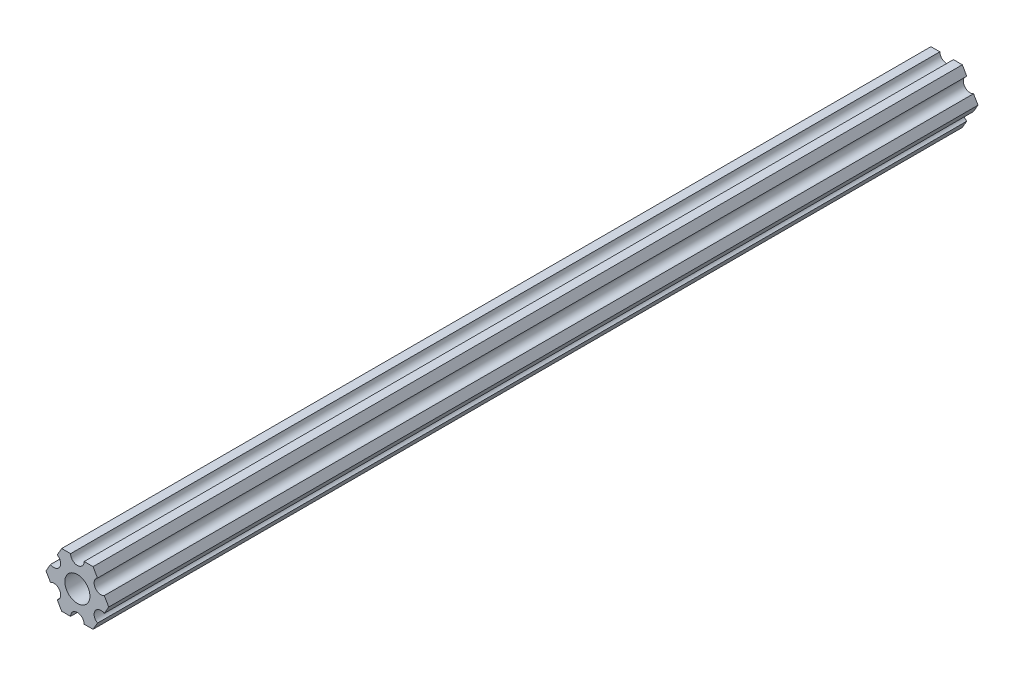
ISO-10303-21;
HEADER;
FILE_DESCRIPTION(('STEP AP214'),'2;1');
FILE_NAME('part.step','',(''),(''),'','','');
FILE_SCHEMA(('AUTOMOTIVE_DESIGN { 1 0 10303 214 1 1 1 1 }'));
ENDSEC;
DATA;
#1=APPLICATION_CONTEXT('core data for automotive mechanical design processes');
#2=APPLICATION_PROTOCOL_DEFINITION('international standard','automotive_design',2000,#1);
#3=PRODUCT_CONTEXT('',#1,'mechanical');
#4=PRODUCT('Part','Part','',(#3));
#5=PRODUCT_RELATED_PRODUCT_CATEGORY('part','',(#4));
#6=PRODUCT_DEFINITION_FORMATION('','',#4);
#7=PRODUCT_DEFINITION_CONTEXT('part definition',#1,'design');
#8=PRODUCT_DEFINITION('design','',#6,#7);
#9=PRODUCT_DEFINITION_SHAPE('','',#8);
#10=(LENGTH_UNIT() NAMED_UNIT(*) SI_UNIT(.MILLI.,.METRE.));
#11=(NAMED_UNIT(*) PLANE_ANGLE_UNIT() SI_UNIT($,.RADIAN.));
#12=(NAMED_UNIT(*) SI_UNIT($,.STERADIAN.) SOLID_ANGLE_UNIT());
#13=UNCERTAINTY_MEASURE_WITH_UNIT(LENGTH_MEASURE(1.E-05),#10,'distance_accuracy_value','');
#14=(GEOMETRIC_REPRESENTATION_CONTEXT(3) GLOBAL_UNCERTAINTY_ASSIGNED_CONTEXT((#13)) GLOBAL_UNIT_ASSIGNED_CONTEXT((#10,
#11,#12)) REPRESENTATION_CONTEXT('',''));
#15=CARTESIAN_POINT('',(0.,0.,0.));
#16=DIRECTION('',(0.,0.,1.));
#17=DIRECTION('',(1.,0.,0.));
#18=AXIS2_PLACEMENT_3D('',#15,#16,#17);
#19=CARTESIAN_POINT('',(-5.49926150638083,-3.17499966684068,-203.2));
#20=DIRECTION('',(0.,0.,1.));
#21=DIRECTION('',(1.,0.,0.));
#22=AXIS2_PLACEMENT_3D('',#19,#20,#21);
#23=CYLINDRICAL_SURFACE('',#22,1.58750000000001);
#24=CARTESIAN_POINT('',(-5.49926150638083,-3.17499966684068,0.));
#25=DIRECTION('',(0.,0.,-1.));
#26=DIRECTION('',(-1.,0.,0.));
#27=AXIS2_PLACEMENT_3D('',#24,#25,#26);
#28=CIRCLE('',#27,1.58750000000001);
#29=CARTESIAN_POINT('',(-6.29301142309098,-1.80018429024546,0.));
#30=VERTEX_POINT('',#29);
#31=CARTESIAN_POINT('',(-4.70551158967068,-4.54981504343589,0.));
#32=VERTEX_POINT('',#31);
#33=EDGE_CURVE('E190',#30,#32,#28,.T.);
#34=ORIENTED_EDGE('',*,*,#33,.F.);
#35=DIRECTION('',(0.,0.,1.));
#36=VECTOR('',#35,1.);
#37=CARTESIAN_POINT('',(-6.29301142309098,-1.80018429024546,-203.2));
#38=LINE('',#37,#36);
#39=CARTESIAN_POINT('',(-6.29301142309098,-1.80018429024546,-203.2));
#40=VERTEX_POINT('',#39);
#41=EDGE_CURVE('E11',#40,#30,#38,.T.);
#42=ORIENTED_EDGE('',*,*,#41,.F.);
#43=CARTESIAN_POINT('',(-5.49926150638083,-3.17499966684068,-203.2));
#44=DIRECTION('',(0.,0.,-1.));
#45=DIRECTION('',(-1.,0.,0.));
#46=AXIS2_PLACEMENT_3D('',#43,#44,#45);
#47=CIRCLE('',#46,1.58750000000001);
#48=CARTESIAN_POINT('',(-4.70551158967068,-4.54981504343589,-203.2));
#49=VERTEX_POINT('',#48);
#50=EDGE_CURVE('E241',#40,#49,#47,.T.);
#51=ORIENTED_EDGE('',*,*,#50,.T.);
#52=DIRECTION('',(0.,0.,1.));
#53=VECTOR('',#52,1.);
#54=CARTESIAN_POINT('',(-4.70551158967068,-4.54981504343589,-203.2));
#55=LINE('',#54,#53);
#56=EDGE_CURVE('E36',#49,#32,#55,.T.);
#57=ORIENTED_EDGE('',*,*,#56,.T.);
#58=EDGE_LOOP('',(#34,#42,#51,#57));
#59=FACE_BOUND('',#58,.T.);
#60=ADVANCED_FACE('F33',(#59),#23,.F.);
#61=CARTESIAN_POINT('',(-7.33234841870826,4.44212518856872E-07,-203.2));
#62=DIRECTION('',(-0.866025434075723,-0.499999947533953,0.));
#63=DIRECTION('',(0.499999947533953,-0.866025434075723,0.));
#64=AXIS2_PLACEMENT_3D('',#61,#62,#63);
#65=PLANE('',#64);
#66=DIRECTION('',(0.499999947533953,-0.866025434075723,0.));
#67=VECTOR('',#66,1.);
#68=CARTESIAN_POINT('',(-7.33234841870826,4.44212518856872E-07,0.));
#69=LINE('',#68,#67);
#70=CARTESIAN_POINT('',(-7.33234841870826,4.44212518856872E-07,0.));
#71=VERTEX_POINT('',#70);
#72=EDGE_CURVE('E239',#71,#30,#69,.T.);
#73=ORIENTED_EDGE('',*,*,#72,.F.);
#74=DIRECTION('',(0.,0.,1.));
#75=VECTOR('',#74,1.);
#76=CARTESIAN_POINT('',(-7.33234841870826,4.44212518856872E-07,-203.2));
#77=LINE('',#76,#75);
#78=CARTESIAN_POINT('',(-7.33234841870826,4.44212518856872E-07,-203.2));
#79=VERTEX_POINT('',#78);
#80=EDGE_CURVE('E42',#79,#71,#77,.T.);
#81=ORIENTED_EDGE('',*,*,#80,.F.);
#82=DIRECTION('',(0.499999947533953,-0.866025434075723,0.));
#83=VECTOR('',#82,1.);
#84=CARTESIAN_POINT('',(-7.33234841870826,4.44212518856872E-07,-203.2));
#85=LINE('',#84,#83);
#86=EDGE_CURVE('E180',#79,#40,#85,.T.);
#87=ORIENTED_EDGE('',*,*,#86,.T.);
#88=ORIENTED_EDGE('',*,*,#41,.T.);
#89=EDGE_LOOP('',(#73,#81,#87,#88));
#90=FACE_BOUND('',#89,.T.);
#91=ADVANCED_FACE('F273',(#90),#65,.T.);
#92=CARTESIAN_POINT('',(-6.29301120497139,1.80018505273895,-203.2));
#93=DIRECTION('',(-0.866025373493145,0.500000052466056,0.));
#94=DIRECTION('',(-0.500000052466056,-0.866025373493145,0.));
#95=AXIS2_PLACEMENT_3D('',#92,#93,#94);
#96=PLANE('',#95);
#97=DIRECTION('',(-0.500000052466056,-0.866025373493145,0.));
#98=VECTOR('',#97,1.);
#99=CARTESIAN_POINT('',(-6.29301120497139,1.80018505273895,0.));
#100=LINE('',#99,#98);
#101=CARTESIAN_POINT('',(-6.29301120497139,1.80018505273895,0.));
#102=VERTEX_POINT('',#101);
#103=EDGE_CURVE('E167',#102,#71,#100,.T.);
#104=ORIENTED_EDGE('',*,*,#103,.F.);
#105=DIRECTION('',(0.,0.,1.));
#106=VECTOR('',#105,1.);
#107=CARTESIAN_POINT('',(-6.29301120497139,1.80018505273895,-203.2));
#108=LINE('',#107,#106);
#109=CARTESIAN_POINT('',(-6.29301120497139,1.80018505273895,-203.2));
#110=VERTEX_POINT('',#109);
#111=EDGE_CURVE('E162',#110,#102,#108,.T.);
#112=ORIENTED_EDGE('',*,*,#111,.F.);
#113=DIRECTION('',(-0.500000052466056,-0.866025373493145,0.));
#114=VECTOR('',#113,1.);
#115=CARTESIAN_POINT('',(-6.29301120497139,1.80018505273895,-203.2));
#116=LINE('',#115,#114);
#117=EDGE_CURVE('E165',#110,#79,#116,.T.);
#118=ORIENTED_EDGE('',*,*,#117,.T.);
#119=ORIENTED_EDGE('',*,*,#80,.T.);
#120=EDGE_LOOP('',(#104,#112,#118,#119));
#121=FACE_BOUND('',#120,.T.);
#122=ADVANCED_FACE('F164',(#121),#96,.T.);
#123=CARTESIAN_POINT('',(-5.49926112168152,3.17500033315931,-203.2));
#124=DIRECTION('',(0.,0.,1.));
#125=DIRECTION('',(1.,0.,0.));
#126=AXIS2_PLACEMENT_3D('',#123,#124,#125);
#127=CYLINDRICAL_SURFACE('',#126,1.5875);
#128=CARTESIAN_POINT('',(-5.49926112168152,3.17500033315931,0.));
#129=DIRECTION('',(0.,0.,-1.));
#130=DIRECTION('',(-1.,0.,0.));
#131=AXIS2_PLACEMENT_3D('',#128,#129,#130);
#132=CIRCLE('',#131,1.5875);
#133=CARTESIAN_POINT('',(-4.70551103839166,4.54981561357968,0.));
#134=VERTEX_POINT('',#133);
#135=EDGE_CURVE('E236',#134,#102,#132,.T.);
#136=ORIENTED_EDGE('',*,*,#135,.F.);
#137=DIRECTION('',(0.,0.,1.));
#138=VECTOR('',#137,1.);
#139=CARTESIAN_POINT('',(-4.70551103839166,4.54981561357968,-203.2));
#140=LINE('',#139,#138);
#141=CARTESIAN_POINT('',(-4.70551103839166,4.54981561357968,-203.2));
#142=VERTEX_POINT('',#141);
#143=EDGE_CURVE('E172',#142,#134,#140,.T.);
#144=ORIENTED_EDGE('',*,*,#143,.F.);
#145=CARTESIAN_POINT('',(-5.49926112168152,3.17500033315931,-203.2));
#146=DIRECTION('',(0.,0.,-1.));
#147=DIRECTION('',(-1.,0.,0.));
#148=AXIS2_PLACEMENT_3D('',#145,#146,#147);
#149=CIRCLE('',#148,1.5875);
#150=EDGE_CURVE('E178',#142,#110,#149,.T.);
#151=ORIENTED_EDGE('',*,*,#150,.T.);
#152=ORIENTED_EDGE('',*,*,#111,.T.);
#153=EDGE_LOOP('',(#136,#144,#151,#152));
#154=FACE_BOUND('',#153,.T.);
#155=ADVANCED_FACE('F182',(#154),#127,.F.);
#156=CARTESIAN_POINT('',(-3.66617382465472,6.35000022210622,-203.2));
#157=DIRECTION('',(-0.866025373493145,0.500000052466056,0.));
#158=DIRECTION('',(-0.500000052466056,-0.866025373493145,0.));
#159=AXIS2_PLACEMENT_3D('',#156,#157,#158);
#160=PLANE('',#159);
#161=DIRECTION('',(-0.500000052466056,-0.866025373493145,0.));
#162=VECTOR('',#161,1.);
#163=CARTESIAN_POINT('',(-3.66617382465472,6.35000022210622,0.));
#164=LINE('',#163,#162);
#165=CARTESIAN_POINT('',(-3.66617382465472,6.35000022210622,0.));
#166=VERTEX_POINT('',#165);
#167=EDGE_CURVE('E233',#166,#134,#164,.T.);
#168=ORIENTED_EDGE('',*,*,#167,.F.);
#169=DIRECTION('',(0.,0.,1.));
#170=VECTOR('',#169,1.);
#171=CARTESIAN_POINT('',(-3.66617382465472,6.35000022210622,-203.2));
#172=LINE('',#171,#170);
#173=CARTESIAN_POINT('',(-3.66617382465472,6.35000022210622,-203.2));
#174=VERTEX_POINT('',#173);
#175=EDGE_CURVE('E245',#174,#166,#172,.T.);
#176=ORIENTED_EDGE('',*,*,#175,.F.);
#177=DIRECTION('',(-0.500000052466056,-0.866025373493145,0.));
#178=VECTOR('',#177,1.);
#179=CARTESIAN_POINT('',(-3.66617382465472,6.35000022210622,-203.2));
#180=LINE('',#179,#178);
#181=EDGE_CURVE('E183',#174,#142,#180,.T.);
#182=ORIENTED_EDGE('',*,*,#181,.T.);
#183=ORIENTED_EDGE('',*,*,#143,.T.);
#184=EDGE_LOOP('',(#168,#176,#182,#183));
#185=FACE_BOUND('',#184,.T.);
#186=ADVANCED_FACE('F286',(#185),#160,.T.);
#187=CARTESIAN_POINT('',(-1.58749884590197,6.35000022210623,-203.2));
#188=DIRECTION('',(0.,1.,0.));
#189=DIRECTION('',(-1.,0.,0.));
#190=AXIS2_PLACEMENT_3D('',#187,#188,#189);
#191=PLANE('',#190);
#192=DIRECTION('',(-1.,0.,0.));
#193=VECTOR('',#192,1.);
#194=CARTESIAN_POINT('',(-1.58749884590197,6.35000022210623,0.));
#195=LINE('',#194,#193);
#196=CARTESIAN_POINT('',(-1.58749884590197,6.35000022210623,0.));
#197=VERTEX_POINT('',#196);
#198=EDGE_CURVE('E230',#197,#166,#195,.T.);
#199=ORIENTED_EDGE('',*,*,#198,.F.);
#200=DIRECTION('',(0.,0.,1.));
#201=VECTOR('',#200,1.);
#202=CARTESIAN_POINT('',(-1.58749884590197,6.35000022210623,-203.2));
#203=LINE('',#202,#201);
#204=CARTESIAN_POINT('',(-1.58749884590197,6.35000022210623,-203.2));
#205=VERTEX_POINT('',#204);
#206=EDGE_CURVE('E247',#205,#197,#203,.T.);
#207=ORIENTED_EDGE('',*,*,#206,.F.);
#208=DIRECTION('',(-1.,0.,0.));
#209=VECTOR('',#208,1.);
#210=CARTESIAN_POINT('',(-1.58749884590197,6.35000022210623,-203.2));
#211=LINE('',#210,#209);
#212=EDGE_CURVE('E185',#205,#174,#211,.T.);
#213=ORIENTED_EDGE('',*,*,#212,.T.);
#214=ORIENTED_EDGE('',*,*,#175,.T.);
#215=EDGE_LOOP('',(#199,#207,#213,#214));
#216=FACE_BOUND('',#215,.T.);
#217=ADVANCED_FACE('F289',(#216),#191,.T.);
#218=CARTESIAN_POINT('',(3.84699344941095E-07,6.35000022210623,-203.2));
#219=DIRECTION('',(0.,0.,1.));
#220=DIRECTION('',(1.,0.,0.));
#221=AXIS2_PLACEMENT_3D('',#218,#219,#220);
#222=CYLINDRICAL_SURFACE('',#221,1.58749884590197);
#223=CARTESIAN_POINT('',(3.84699344941095E-07,6.35000022210623,0.));
#224=DIRECTION('',(0.,0.,-1.));
#225=DIRECTION('',(-1.,0.,0.));
#226=AXIS2_PLACEMENT_3D('',#223,#224,#225);
#227=CIRCLE('',#226,1.58749884590197);
#228=CARTESIAN_POINT('',(1.58749923060131,6.35000022210623,0.));
#229=VERTEX_POINT('',#228);
#230=EDGE_CURVE('E227',#229,#197,#227,.T.);
#231=ORIENTED_EDGE('',*,*,#230,.F.);
#232=DIRECTION('',(0.,0.,1.));
#233=VECTOR('',#232,1.);
#234=CARTESIAN_POINT('',(1.58749923060131,6.35000022210623,-203.2));
#235=LINE('',#234,#233);
#236=CARTESIAN_POINT('',(1.58749923060131,6.35000022210623,-203.2));
#237=VERTEX_POINT('',#236);
#238=EDGE_CURVE('E249',#237,#229,#235,.T.);
#239=ORIENTED_EDGE('',*,*,#238,.F.);
#240=CARTESIAN_POINT('',(3.84699344941095E-07,6.35000022210623,-203.2));
#241=DIRECTION('',(0.,0.,-1.));
#242=DIRECTION('',(-1.,0.,0.));
#243=AXIS2_PLACEMENT_3D('',#240,#241,#242);
#244=CIRCLE('',#243,1.58749884590197);
#245=EDGE_CURVE('E394',#237,#205,#244,.T.);
#246=ORIENTED_EDGE('',*,*,#245,.T.);
#247=ORIENTED_EDGE('',*,*,#206,.T.);
#248=EDGE_LOOP('',(#231,#239,#246,#247));
#249=FACE_BOUND('',#248,.T.);
#250=ADVANCED_FACE('F293',(#249),#222,.F.);
#251=CARTESIAN_POINT('',(3.66617452134701,6.35000022210623,-203.2));
#252=DIRECTION('',(0.,1.,0.));
#253=DIRECTION('',(-1.,0.,0.));
#254=AXIS2_PLACEMENT_3D('',#251,#252,#253);
#255=PLANE('',#254);
#256=DIRECTION('',(-1.,0.,0.));
#257=VECTOR('',#256,1.);
#258=CARTESIAN_POINT('',(3.66617452134701,6.35000022210623,0.));
#259=LINE('',#258,#257);
#260=CARTESIAN_POINT('',(3.66617452134701,6.35000022210623,0.));
#261=VERTEX_POINT('',#260);
#262=EDGE_CURVE('E224',#261,#229,#259,.T.);
#263=ORIENTED_EDGE('',*,*,#262,.F.);
#264=DIRECTION('',(0.,0.,1.));
#265=VECTOR('',#264,1.);
#266=CARTESIAN_POINT('',(3.66617452134701,6.35000022210623,-203.2));
#267=LINE('',#266,#265);
#268=CARTESIAN_POINT('',(3.66617452134701,6.35000022210623,-203.2));
#269=VERTEX_POINT('',#268);
#270=EDGE_CURVE('E251',#269,#261,#267,.T.);
#271=ORIENTED_EDGE('',*,*,#270,.F.);
#272=DIRECTION('',(-1.,0.,0.));
#273=VECTOR('',#272,1.);
#274=CARTESIAN_POINT('',(3.66617452134701,6.35000022210623,-203.2));
#275=LINE('',#274,#273);
#276=EDGE_CURVE('E391',#269,#237,#275,.T.);
#277=ORIENTED_EDGE('',*,*,#276,.T.);
#278=ORIENTED_EDGE('',*,*,#238,.T.);
#279=EDGE_LOOP('',(#263,#271,#277,#278));
#280=FACE_BOUND('',#279,.T.);
#281=ADVANCED_FACE('F297',(#280),#255,.T.);
#282=CARTESIAN_POINT('',(4.70551142760333,4.54981551649452,-203.2));
#283=DIRECTION('',(0.866025449221368,0.499999921300922,0.));
#284=DIRECTION('',(-0.499999921300922,0.866025449221368,0.));
#285=AXIS2_PLACEMENT_3D('',#282,#283,#284);
#286=PLANE('',#285);
#287=DIRECTION('',(-0.499999921300922,0.866025449221368,0.));
#288=VECTOR('',#287,1.);
#289=CARTESIAN_POINT('',(4.70551142760333,4.54981551649452,0.));
#290=LINE('',#289,#288);
#291=CARTESIAN_POINT('',(4.70551142760333,4.54981551649452,0.));
#292=VERTEX_POINT('',#291);
#293=EDGE_CURVE('E221',#292,#261,#290,.T.);
#294=ORIENTED_EDGE('',*,*,#293,.F.);
#295=DIRECTION('',(0.,0.,1.));
#296=VECTOR('',#295,1.);
#297=CARTESIAN_POINT('',(4.70551142760333,4.54981551649452,-203.2));
#298=LINE('',#297,#296);
#299=CARTESIAN_POINT('',(4.70551142760333,4.54981551649452,-203.2));
#300=VERTEX_POINT('',#299);
#301=EDGE_CURVE('E253',#300,#292,#298,.T.);
#302=ORIENTED_EDGE('',*,*,#301,.F.);
#303=DIRECTION('',(-0.499999921300922,0.866025449221368,0.));
#304=VECTOR('',#303,1.);
#305=CARTESIAN_POINT('',(4.70551142760333,4.54981551649452,-203.2));
#306=LINE('',#305,#304);
#307=EDGE_CURVE('E388',#300,#269,#306,.T.);
#308=ORIENTED_EDGE('',*,*,#307,.T.);
#309=ORIENTED_EDGE('',*,*,#270,.T.);
#310=EDGE_LOOP('',(#294,#302,#308,#309));
#311=FACE_BOUND('',#310,.T.);
#312=ADVANCED_FACE('F301',(#311),#286,.T.);
#313=CARTESIAN_POINT('',(5.49926130266854,3.1750001158556,-203.2));
#314=DIRECTION('',(0.,0.,1.));
#315=DIRECTION('',(1.,0.,0.));
#316=AXIS2_PLACEMENT_3D('',#313,#314,#315);
#317=CYLINDRICAL_SURFACE('',#316,1.5875);
#318=CARTESIAN_POINT('',(5.49926130266854,3.1750001158556,0.));
#319=DIRECTION('',(0.,0.,-1.));
#320=DIRECTION('',(-1.,0.,0.));
#321=AXIS2_PLACEMENT_3D('',#318,#319,#320);
#322=CIRCLE('',#321,1.5875);
#323=CARTESIAN_POINT('',(6.29301117773375,1.80018471521667,0.));
#324=VERTEX_POINT('',#323);
#325=EDGE_CURVE('E218',#324,#292,#322,.T.);
#326=ORIENTED_EDGE('',*,*,#325,.F.);
#327=DIRECTION('',(0.,0.,1.));
#328=VECTOR('',#327,1.);
#329=CARTESIAN_POINT('',(6.29301117773375,1.80018471521667,-203.2));
#330=LINE('',#329,#328);
#331=CARTESIAN_POINT('',(6.29301117773375,1.80018471521667,-203.2));
#332=VERTEX_POINT('',#331);
#333=EDGE_CURVE('E255',#332,#324,#330,.T.);
#334=ORIENTED_EDGE('',*,*,#333,.F.);
#335=CARTESIAN_POINT('',(5.49926130266854,3.1750001158556,-203.2));
#336=DIRECTION('',(0.,0.,-1.));
#337=DIRECTION('',(-1.,0.,0.));
#338=AXIS2_PLACEMENT_3D('',#335,#336,#337);
#339=CIRCLE('',#338,1.5875);
#340=EDGE_CURVE('E385',#332,#300,#339,.T.);
#341=ORIENTED_EDGE('',*,*,#340,.T.);
#342=ORIENTED_EDGE('',*,*,#301,.T.);
#343=EDGE_LOOP('',(#326,#334,#341,#342));
#344=FACE_BOUND('',#343,.T.);
#345=ADVANCED_FACE('F305',(#344),#317,.F.);
#346=CARTESIAN_POINT('',(7.33234803400895,9.61748368946088E-08,-203.2));
#347=DIRECTION('',(0.866025449221368,0.499999921300922,0.));
#348=DIRECTION('',(-0.499999921300922,0.866025449221368,0.));
#349=AXIS2_PLACEMENT_3D('',#346,#347,#348);
#350=PLANE('',#349);
#351=DIRECTION('',(-0.499999921300922,0.866025449221368,0.));
#352=VECTOR('',#351,1.);
#353=CARTESIAN_POINT('',(7.33234803400895,9.61748368946088E-08,0.));
#354=LINE('',#353,#352);
#355=CARTESIAN_POINT('',(7.33234803400895,9.61748368946088E-08,0.));
#356=VERTEX_POINT('',#355);
#357=EDGE_CURVE('E215',#356,#324,#354,.T.);
#358=ORIENTED_EDGE('',*,*,#357,.F.);
#359=DIRECTION('',(0.,0.,1.));
#360=VECTOR('',#359,1.);
#361=CARTESIAN_POINT('',(7.33234803400895,9.61748368946088E-08,-203.2));
#362=LINE('',#361,#360);
#363=CARTESIAN_POINT('',(7.33234803400895,9.61748368946088E-08,-203.2));
#364=VERTEX_POINT('',#363);
#365=EDGE_CURVE('E257',#364,#356,#362,.T.);
#366=ORIENTED_EDGE('',*,*,#365,.F.);
#367=DIRECTION('',(-0.499999921300922,0.866025449221368,0.));
#368=VECTOR('',#367,1.);
#369=CARTESIAN_POINT('',(7.33234803400895,9.61748368946088E-08,-203.2));
#370=LINE('',#369,#368);
#371=EDGE_CURVE('E382',#364,#332,#370,.T.);
#372=ORIENTED_EDGE('',*,*,#371,.T.);
#373=ORIENTED_EDGE('',*,*,#333,.T.);
#374=EDGE_LOOP('',(#358,#366,#372,#373));
#375=FACE_BOUND('',#374,.T.);
#376=ADVANCED_FACE('F309',(#375),#350,.T.);
#377=CARTESIAN_POINT('',(6.29301092933191,-1.80018457531732,-203.2));
#378=DIRECTION('',(0.866025403784438,-0.5,0.));
#379=DIRECTION('',(0.5,0.866025403784438,0.));
#380=AXIS2_PLACEMENT_3D('',#377,#378,#379);
#381=PLANE('',#380);
#382=DIRECTION('',(0.5,0.866025403784438,0.));
#383=VECTOR('',#382,1.);
#384=CARTESIAN_POINT('',(6.29301092933191,-1.80018457531732,0.));
#385=LINE('',#384,#383);
#386=CARTESIAN_POINT('',(6.29301092933191,-1.80018457531732,0.));
#387=VERTEX_POINT('',#386);
#388=EDGE_CURVE('E212',#387,#356,#385,.T.);
#389=ORIENTED_EDGE('',*,*,#388,.F.);
#390=DIRECTION('',(0.,0.,1.));
#391=VECTOR('',#390,1.);
#392=CARTESIAN_POINT('',(6.29301092933191,-1.80018457531732,-203.2));
#393=LINE('',#392,#391);
#394=CARTESIAN_POINT('',(6.29301092933191,-1.80018457531732,-203.2));
#395=VERTEX_POINT('',#394);
#396=EDGE_CURVE('E259',#395,#387,#393,.T.);
#397=ORIENTED_EDGE('',*,*,#396,.F.);
#398=DIRECTION('',(0.5,0.866025403784438,0.));
#399=VECTOR('',#398,1.);
#400=CARTESIAN_POINT('',(6.29301092933191,-1.80018457531732,-203.2));
#401=LINE('',#400,#399);
#402=EDGE_CURVE('E379',#395,#364,#401,.T.);
#403=ORIENTED_EDGE('',*,*,#402,.T.);
#404=ORIENTED_EDGE('',*,*,#365,.T.);
#405=EDGE_LOOP('',(#389,#397,#403,#404));
#406=FACE_BOUND('',#405,.T.);
#407=ADVANCED_FACE('F313',(#406),#381,.T.);
#408=CARTESIAN_POINT('',(5.49926092933191,-3.17499990382512,-203.2));
#409=DIRECTION('',(0.,0.,1.));
#410=DIRECTION('',(1.,0.,0.));
#411=AXIS2_PLACEMENT_3D('',#408,#409,#410);
#412=CYLINDRICAL_SURFACE('',#411,1.5875);
#413=CARTESIAN_POINT('',(5.49926092933191,-3.17499990382512,0.));
#414=DIRECTION('',(0.,0.,-1.));
#415=DIRECTION('',(-1.,0.,0.));
#416=AXIS2_PLACEMENT_3D('',#413,#414,#415);
#417=CIRCLE('',#416,1.5875);
#418=CARTESIAN_POINT('',(4.70551092933191,-4.54981523233291,0.));
#419=VERTEX_POINT('',#418);
#420=EDGE_CURVE('E209',#419,#387,#417,.T.);
#421=ORIENTED_EDGE('',*,*,#420,.F.);
#422=DIRECTION('',(0.,0.,1.));
#423=VECTOR('',#422,1.);
#424=CARTESIAN_POINT('',(4.70551092933191,-4.54981523233291,-203.2));
#425=LINE('',#424,#423);
#426=CARTESIAN_POINT('',(4.70551092933191,-4.54981523233291,-203.2));
#427=VERTEX_POINT('',#426);
#428=EDGE_CURVE('E261',#427,#419,#425,.T.);
#429=ORIENTED_EDGE('',*,*,#428,.F.);
#430=CARTESIAN_POINT('',(5.49926092933191,-3.17499990382512,-203.2));
#431=DIRECTION('',(0.,0.,-1.));
#432=DIRECTION('',(-1.,0.,0.));
#433=AXIS2_PLACEMENT_3D('',#430,#431,#432);
#434=CIRCLE('',#433,1.5875);
#435=EDGE_CURVE('E376',#427,#395,#434,.T.);
#436=ORIENTED_EDGE('',*,*,#435,.T.);
#437=ORIENTED_EDGE('',*,*,#396,.T.);
#438=EDGE_LOOP('',(#421,#429,#436,#437));
#439=FACE_BOUND('',#438,.T.);
#440=ADVANCED_FACE('F317',(#439),#412,.F.);
#441=CARTESIAN_POINT('',(3.66617382465481,-6.34999990382519,-203.2));
#442=DIRECTION('',(0.866025403784438,-0.5,0.));
#443=DIRECTION('',(0.5,0.866025403784439,0.));
#444=AXIS2_PLACEMENT_3D('',#441,#442,#443);
#445=PLANE('',#444);
#446=DIRECTION('',(0.5,0.866025403784439,0.));
#447=VECTOR('',#446,1.);
#448=CARTESIAN_POINT('',(3.66617382465481,-6.34999990382519,0.));
#449=LINE('',#448,#447);
#450=CARTESIAN_POINT('',(3.66617382465481,-6.34999990382519,0.));
#451=VERTEX_POINT('',#450);
#452=EDGE_CURVE('E206',#451,#419,#449,.T.);
#453=ORIENTED_EDGE('',*,*,#452,.F.);
#454=DIRECTION('',(0.,0.,1.));
#455=VECTOR('',#454,1.);
#456=CARTESIAN_POINT('',(3.66617382465481,-6.34999990382519,-203.2));
#457=LINE('',#456,#455);
#458=CARTESIAN_POINT('',(3.66617382465481,-6.34999990382519,-203.2));
#459=VERTEX_POINT('',#458);
#460=EDGE_CURVE('E263',#459,#451,#457,.T.);
#461=ORIENTED_EDGE('',*,*,#460,.F.);
#462=DIRECTION('',(0.5,0.866025403784439,0.));
#463=VECTOR('',#462,1.);
#464=CARTESIAN_POINT('',(3.66617382465481,-6.34999990382519,-203.2));
#465=LINE('',#464,#463);
#466=EDGE_CURVE('E373',#459,#427,#465,.T.);
#467=ORIENTED_EDGE('',*,*,#466,.T.);
#468=ORIENTED_EDGE('',*,*,#428,.T.);
#469=EDGE_LOOP('',(#453,#461,#467,#468));
#470=FACE_BOUND('',#469,.T.);
#471=ADVANCED_FACE('F321',(#470),#445,.T.);
#472=CARTESIAN_POINT('',(1.58750115409778,-6.34999990382519,-203.2));
#473=DIRECTION('',(0.,-1.,0.));
#474=DIRECTION('',(1.,0.,0.));
#475=AXIS2_PLACEMENT_3D('',#472,#473,#474);
#476=PLANE('',#475);
#477=DIRECTION('',(1.,0.,0.));
#478=VECTOR('',#477,1.);
#479=CARTESIAN_POINT('',(1.58750115409778,-6.34999990382519,0.));
#480=LINE('',#479,#478);
#481=CARTESIAN_POINT('',(1.58750115409778,-6.34999990382519,0.));
#482=VERTEX_POINT('',#481);
#483=EDGE_CURVE('E203',#482,#451,#480,.T.);
#484=ORIENTED_EDGE('',*,*,#483,.F.);
#485=DIRECTION('',(0.,0.,1.));
#486=VECTOR('',#485,1.);
#487=CARTESIAN_POINT('',(1.58750115409778,-6.34999990382519,-203.2));
#488=LINE('',#487,#486);
#489=CARTESIAN_POINT('',(1.58750115409778,-6.34999990382519,-203.2));
#490=VERTEX_POINT('',#489);
#491=EDGE_CURVE('E265',#490,#482,#488,.T.);
#492=ORIENTED_EDGE('',*,*,#491,.F.);
#493=DIRECTION('',(1.,0.,0.));
#494=VECTOR('',#493,1.);
#495=CARTESIAN_POINT('',(1.58750115409778,-6.34999990382519,-203.2));
#496=LINE('',#495,#494);
#497=EDGE_CURVE('E370',#490,#459,#496,.T.);
#498=ORIENTED_EDGE('',*,*,#497,.T.);
#499=ORIENTED_EDGE('',*,*,#460,.T.);
#500=EDGE_LOOP('',(#484,#492,#498,#499));
#501=FACE_BOUND('',#500,.T.);
#502=ADVANCED_FACE('F325',(#501),#476,.T.);
#503=CARTESIAN_POINT('',(-3.8469926204343E-07,-6.34999990382519,-203.2));
#504=DIRECTION('',(0.,0.,1.));
#505=DIRECTION('',(1.,0.,0.));
#506=AXIS2_PLACEMENT_3D('',#503,#504,#505);
#507=CYLINDRICAL_SURFACE('',#506,1.58750115409778);
#508=CARTESIAN_POINT('',(-3.8469926204343E-07,-6.34999990382519,0.));
#509=DIRECTION('',(0.,0.,-1.));
#510=DIRECTION('',(-1.,0.,0.));
#511=AXIS2_PLACEMENT_3D('',#508,#509,#510);
#512=CIRCLE('',#511,1.58750115409778);
#513=CARTESIAN_POINT('',(-1.58750153879705,-6.34999990382519,0.));
#514=VERTEX_POINT('',#513);
#515=EDGE_CURVE('E200',#514,#482,#512,.T.);
#516=ORIENTED_EDGE('',*,*,#515,.F.);
#517=DIRECTION('',(0.,0.,1.));
#518=VECTOR('',#517,1.);
#519=CARTESIAN_POINT('',(-1.58750153879705,-6.34999990382519,-203.2));
#520=LINE('',#519,#518);
#521=CARTESIAN_POINT('',(-1.58750153879705,-6.34999990382519,-203.2));
#522=VERTEX_POINT('',#521);
#523=EDGE_CURVE('E267',#522,#514,#520,.T.);
#524=ORIENTED_EDGE('',*,*,#523,.F.);
#525=CARTESIAN_POINT('',(-3.8469926204343E-07,-6.34999990382519,-203.2));
#526=DIRECTION('',(0.,0.,-1.));
#527=DIRECTION('',(-1.,0.,0.));
#528=AXIS2_PLACEMENT_3D('',#525,#526,#527);
#529=CIRCLE('',#528,1.58750115409778);
#530=EDGE_CURVE('E367',#522,#490,#529,.T.);
#531=ORIENTED_EDGE('',*,*,#530,.T.);
#532=ORIENTED_EDGE('',*,*,#491,.T.);
#533=EDGE_LOOP('',(#516,#524,#531,#532));
#534=FACE_BOUND('',#533,.T.);
#535=ADVANCED_FACE('F329',(#534),#507,.F.);
#536=CARTESIAN_POINT('',(-3.66617452134693,-6.34999990382519,-203.2));
#537=DIRECTION('',(0.,-1.,0.));
#538=DIRECTION('',(1.,0.,0.));
#539=AXIS2_PLACEMENT_3D('',#536,#537,#538);
#540=PLANE('',#539);
#541=DIRECTION('',(1.,0.,0.));
#542=VECTOR('',#541,1.);
#543=CARTESIAN_POINT('',(-3.66617452134693,-6.34999990382519,0.));
#544=LINE('',#543,#542);
#545=CARTESIAN_POINT('',(-3.66617452134693,-6.34999990382519,0.));
#546=VERTEX_POINT('',#545);
#547=EDGE_CURVE('E197',#546,#514,#544,.T.);
#548=ORIENTED_EDGE('',*,*,#547,.F.);
#549=DIRECTION('',(0.,0.,1.));
#550=VECTOR('',#549,1.);
#551=CARTESIAN_POINT('',(-3.66617452134693,-6.34999990382519,-203.2));
#552=LINE('',#551,#550);
#553=CARTESIAN_POINT('',(-3.66617452134693,-6.34999990382519,-203.2));
#554=VERTEX_POINT('',#553);
#555=EDGE_CURVE('E268',#554,#546,#552,.T.);
#556=ORIENTED_EDGE('',*,*,#555,.F.);
#557=DIRECTION('',(1.,0.,0.));
#558=VECTOR('',#557,1.);
#559=CARTESIAN_POINT('',(-3.66617452134693,-6.34999990382519,-203.2));
#560=LINE('',#559,#558);
#561=EDGE_CURVE('E364',#554,#522,#560,.T.);
#562=ORIENTED_EDGE('',*,*,#561,.T.);
#563=ORIENTED_EDGE('',*,*,#523,.T.);
#564=EDGE_LOOP('',(#548,#556,#562,#563));
#565=FACE_BOUND('',#564,.T.);
#566=ADVANCED_FACE('F333',(#565),#540,.T.);
#567=CARTESIAN_POINT('',(-4.70551158967068,-4.54981504343589,-203.2));
#568=DIRECTION('',(-0.866025434075723,-0.499999947533953,0.));
#569=DIRECTION('',(0.499999947533953,-0.866025434075723,0.));
#570=AXIS2_PLACEMENT_3D('',#567,#568,#569);
#571=PLANE('',#570);
#572=DIRECTION('',(0.499999947533953,-0.866025434075723,0.));
#573=VECTOR('',#572,1.);
#574=CARTESIAN_POINT('',(-4.70551158967068,-4.54981504343589,0.));
#575=LINE('',#574,#573);
#576=EDGE_CURVE('E193',#32,#546,#575,.T.);
#577=ORIENTED_EDGE('',*,*,#576,.F.);
#578=ORIENTED_EDGE('',*,*,#56,.F.);
#579=DIRECTION('',(0.499999947533953,-0.866025434075723,0.));
#580=VECTOR('',#579,1.);
#581=CARTESIAN_POINT('',(-4.70551158967068,-4.54981504343589,-203.2));
#582=LINE('',#581,#580);
#583=EDGE_CURVE('E362',#49,#554,#582,.T.);
#584=ORIENTED_EDGE('',*,*,#583,.T.);
#585=ORIENTED_EDGE('',*,*,#555,.T.);
#586=EDGE_LOOP('',(#577,#578,#584,#585));
#587=FACE_BOUND('',#586,.T.);
#588=ADVANCED_FACE('F270',(#587),#571,.T.);
#589=CARTESIAN_POINT('',(-5.49926150638083,-3.17499966684068,-203.2));
#590=DIRECTION('',(0.,0.,-1.));
#591=DIRECTION('',(-1.,0.,0.));
#592=AXIS2_PLACEMENT_3D('',#589,#590,#591);
#593=PLANE('',#592);
#594=CARTESIAN_POINT('',(0.,0.,-203.2));
#595=DIRECTION('',(0.,0.,1.));
#596=DIRECTION('',(-1.,0.,0.));
#597=AXIS2_PLACEMENT_3D('',#594,#595,#596);
#598=CIRCLE('',#597,2.9337);
#599=CARTESIAN_POINT('',(-2.9337,0.,-203.2));
#600=VERTEX_POINT('',#599);
#601=EDGE_CURVE('E194',#600,#600,#598,.T.);
#602=ORIENTED_EDGE('',*,*,#601,.T.);
#603=EDGE_LOOP('',(#602));
#604=FACE_BOUND('',#603,.T.);
#605=ORIENTED_EDGE('',*,*,#50,.F.);
#606=ORIENTED_EDGE('',*,*,#86,.F.);
#607=ORIENTED_EDGE('',*,*,#117,.F.);
#608=ORIENTED_EDGE('',*,*,#150,.F.);
#609=ORIENTED_EDGE('',*,*,#181,.F.);
#610=ORIENTED_EDGE('',*,*,#212,.F.);
#611=ORIENTED_EDGE('',*,*,#245,.F.);
#612=ORIENTED_EDGE('',*,*,#276,.F.);
#613=ORIENTED_EDGE('',*,*,#307,.F.);
#614=ORIENTED_EDGE('',*,*,#340,.F.);
#615=ORIENTED_EDGE('',*,*,#371,.F.);
#616=ORIENTED_EDGE('',*,*,#402,.F.);
#617=ORIENTED_EDGE('',*,*,#435,.F.);
#618=ORIENTED_EDGE('',*,*,#466,.F.);
#619=ORIENTED_EDGE('',*,*,#497,.F.);
#620=ORIENTED_EDGE('',*,*,#530,.F.);
#621=ORIENTED_EDGE('',*,*,#561,.F.);
#622=ORIENTED_EDGE('',*,*,#583,.F.);
#623=EDGE_LOOP('',(#605,#606,#607,#608,#609,#610,#611,#612,#613,#614,#615,#616,#617,#618,#619,
#620,#621,#622));
#624=FACE_BOUND('',#623,.T.);
#625=ADVANCED_FACE('F176',(#604,#624),#593,.T.);
#626=CARTESIAN_POINT('',(-5.49926150638083,-3.17499966684068,0.));
#627=DIRECTION('',(0.,0.,-1.));
#628=DIRECTION('',(-1.,0.,0.));
#629=AXIS2_PLACEMENT_3D('',#626,#627,#628);
#630=PLANE('',#629);
#631=CARTESIAN_POINT('',(0.,0.,0.));
#632=DIRECTION('',(0.,0.,1.));
#633=DIRECTION('',(-1.,0.,0.));
#634=AXIS2_PLACEMENT_3D('',#631,#632,#633);
#635=CIRCLE('',#634,2.9337);
#636=CARTESIAN_POINT('',(-2.9337,0.,0.));
#637=VERTEX_POINT('',#636);
#638=EDGE_CURVE('E357',#637,#637,#635,.T.);
#639=ORIENTED_EDGE('',*,*,#638,.F.);
#640=EDGE_LOOP('',(#639));
#641=FACE_BOUND('',#640,.T.);
#642=ORIENTED_EDGE('',*,*,#33,.T.);
#643=ORIENTED_EDGE('',*,*,#576,.T.);
#644=ORIENTED_EDGE('',*,*,#547,.T.);
#645=ORIENTED_EDGE('',*,*,#515,.T.);
#646=ORIENTED_EDGE('',*,*,#483,.T.);
#647=ORIENTED_EDGE('',*,*,#452,.T.);
#648=ORIENTED_EDGE('',*,*,#420,.T.);
#649=ORIENTED_EDGE('',*,*,#388,.T.);
#650=ORIENTED_EDGE('',*,*,#357,.T.);
#651=ORIENTED_EDGE('',*,*,#325,.T.);
#652=ORIENTED_EDGE('',*,*,#293,.T.);
#653=ORIENTED_EDGE('',*,*,#262,.T.);
#654=ORIENTED_EDGE('',*,*,#230,.T.);
#655=ORIENTED_EDGE('',*,*,#198,.T.);
#656=ORIENTED_EDGE('',*,*,#167,.T.);
#657=ORIENTED_EDGE('',*,*,#135,.T.);
#658=ORIENTED_EDGE('',*,*,#103,.T.);
#659=ORIENTED_EDGE('',*,*,#72,.T.);
#660=EDGE_LOOP('',(#642,#643,#644,#645,#646,#647,#648,#649,#650,#651,#652,#653,#654,#655,#656,
#657,#658,#659));
#661=FACE_BOUND('',#660,.T.);
#662=ADVANCED_FACE('F272',(#641,#661),#630,.F.);
#663=CARTESIAN_POINT('',(0.,0.,-203.2));
#664=DIRECTION('',(0.,0.,1.));
#665=DIRECTION('',(1.,0.,0.));
#666=AXIS2_PLACEMENT_3D('',#663,#664,#665);
#667=CYLINDRICAL_SURFACE('',#666,2.9337);
#668=ORIENTED_EDGE('',*,*,#601,.F.);
#669=EDGE_LOOP('',(#668));
#670=FACE_BOUND('',#669,.T.);
#671=ORIENTED_EDGE('',*,*,#638,.T.);
#672=EDGE_LOOP('',(#671));
#673=FACE_BOUND('',#672,.T.);
#674=ADVANCED_FACE('F345',(#670,#673),#667,.F.);
#675=CLOSED_SHELL('',(#60,#91,#122,#155,#186,#217,#250,#281,#312,#345,#376,#407,#440,#471,#502,
#535,#566,#588,#625,#662,#674));
#676=MANIFOLD_SOLID_BREP('B2',#675);
#677=ADVANCED_BREP_SHAPE_REPRESENTATION('',(#18,#676),#14);
#678=SHAPE_DEFINITION_REPRESENTATION(#9,#677);
ENDSEC;
END-ISO-10303-21;
